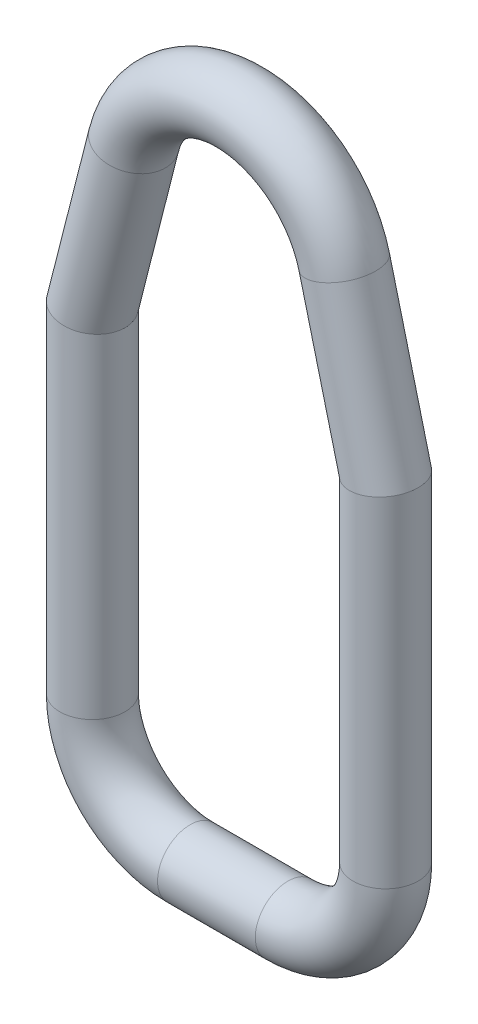
ISO-10303-21;
HEADER;
FILE_DESCRIPTION(('STEP AP214'),'2;1');
FILE_NAME('part.step','',(''),(''),'','','');
FILE_SCHEMA(('AUTOMOTIVE_DESIGN { 1 0 10303 214 1 1 1 1 }'));
ENDSEC;
DATA;
#1=APPLICATION_CONTEXT('core data for automotive mechanical design processes');
#2=APPLICATION_PROTOCOL_DEFINITION('international standard','automotive_design',2000,#1);
#3=PRODUCT_CONTEXT('',#1,'mechanical');
#4=PRODUCT('Part','Part','',(#3));
#5=PRODUCT_RELATED_PRODUCT_CATEGORY('part','',(#4));
#6=PRODUCT_DEFINITION_FORMATION('','',#4);
#7=PRODUCT_DEFINITION_CONTEXT('part definition',#1,'design');
#8=PRODUCT_DEFINITION('design','',#6,#7);
#9=PRODUCT_DEFINITION_SHAPE('','',#8);
#10=(LENGTH_UNIT() NAMED_UNIT(*) SI_UNIT(.MILLI.,.METRE.));
#11=(NAMED_UNIT(*) PLANE_ANGLE_UNIT() SI_UNIT($,.RADIAN.));
#12=(NAMED_UNIT(*) SI_UNIT($,.STERADIAN.) SOLID_ANGLE_UNIT());
#13=UNCERTAINTY_MEASURE_WITH_UNIT(LENGTH_MEASURE(1.E-05),#10,'distance_accuracy_value','');
#14=(GEOMETRIC_REPRESENTATION_CONTEXT(3) GLOBAL_UNCERTAINTY_ASSIGNED_CONTEXT((#13)) GLOBAL_UNIT_ASSIGNED_CONTEXT((#10,
#11,#12)) REPRESENTATION_CONTEXT('',''));
#15=CARTESIAN_POINT('',(0.,0.,0.));
#16=DIRECTION('',(0.,0.,1.));
#17=DIRECTION('',(1.,0.,0.));
#18=AXIS2_PLACEMENT_3D('',#15,#16,#17);
#19=CARTESIAN_POINT('',(-1.143,2.286,0.));
#20=DIRECTION('',(0.,0.,1.));
#21=DIRECTION('',(1.,0.,0.));
#22=AXIS2_PLACEMENT_3D('',#19,#20,#21);
#23=TOROIDAL_SURFACE('',#22,2.286,0.762);
#24=CARTESIAN_POINT('',(-3.429,2.286,0.));
#25=DIRECTION('',(0.,-1.,0.));
#26=DIRECTION('',(0.,0.,-1.));
#27=AXIS2_PLACEMENT_3D('',#24,#25,#26);
#28=CIRCLE('',#27,0.762);
#29=CARTESIAN_POINT('',(-4.191,2.286,0.));
#30=VERTEX_POINT('',#29);
#31=EDGE_CURVE('E51',#30,#30,#28,.T.);
#32=CARTESIAN_POINT('',(-1.143,0.,0.));
#33=DIRECTION('',(1.,0.,0.));
#34=DIRECTION('',(0.,0.,-1.));
#35=AXIS2_PLACEMENT_3D('',#32,#33,#34);
#36=CIRCLE('',#35,0.762);
#37=CARTESIAN_POINT('',(-1.143,-0.761999999999999,0.));
#38=VERTEX_POINT('',#37);
#39=EDGE_CURVE('E11',#38,#38,#36,.T.);
#40=CARTESIAN_POINT('',(-1.143,2.286,0.));
#41=DIRECTION('',(0.,0.,1.));
#42=DIRECTION('',(1.,0.,0.));
#43=AXIS2_PLACEMENT_3D('',#40,#41,#42);
#44=CIRCLE('',#43,3.048);
#45=EDGE_CURVE('',#30,#38,#44,.T.);
#46=ORIENTED_EDGE('',*,*,#31,.T.);
#47=ORIENTED_EDGE('',*,*,#39,.F.);
#48=ORIENTED_EDGE('',*,*,#45,.T.);
#49=ORIENTED_EDGE('',*,*,#45,.F.);
#50=EDGE_LOOP('',(#46,#48,#47,#49));
#51=FACE_BOUND('',#50,.T.);
#52=ADVANCED_FACE('F45',(#51),#23,.T.);
#53=CARTESIAN_POINT('',(-3.429,10.16,0.));
#54=DIRECTION('',(0.,-1.,0.));
#55=DIRECTION('',(1.,0.,0.));
#56=AXIS2_PLACEMENT_3D('',#53,#54,#55);
#57=CYLINDRICAL_SURFACE('',#56,0.762);
#58=CARTESIAN_POINT('',(-3.429,10.16,0.));
#59=DIRECTION('',(-0.124281895094547,-0.992246950386701,0.));
#60=DIRECTION('',(-0.992246950386701,0.124281895094547,0.));
#61=AXIS2_PLACEMENT_3D('',#58,#59,#60);
#62=ELLIPSE('',#61,0.767953985349143,0.762);
#63=CARTESIAN_POINT('',(-4.191,10.2554427766446,0.));
#64=VERTEX_POINT('',#63);
#65=EDGE_CURVE('E55',#64,#64,#62,.F.);
#66=ORIENTED_EDGE('',*,*,#65,.F.);
#67=EDGE_LOOP('',(#66));
#68=FACE_BOUND('',#67,.T.);
#69=ORIENTED_EDGE('',*,*,#31,.F.);
#70=EDGE_LOOP('',(#69));
#71=FACE_BOUND('',#70,.T.);
#72=ADVANCED_FACE('F89',(#68,#71),#57,.T.);
#73=CARTESIAN_POINT('',(-2.46153437360268,13.9614571234909,0.));
#74=DIRECTION('',(-0.246636662791689,-0.969108021103416,0.));
#75=DIRECTION('',(0.969108021103416,-0.246636662791689,0.));
#76=AXIS2_PLACEMENT_3D('',#73,#74,#75);
#77=CYLINDRICAL_SURFACE('',#76,0.762);
#78=CARTESIAN_POINT('',(-2.46153437360268,13.9614571234909,0.));
#79=DIRECTION('',(-0.246636662791689,-0.969108021103416,0.));
#80=DIRECTION('',(0.969108021103416,-0.246636662791689,0.));
#81=AXIS2_PLACEMENT_3D('',#78,#79,#80);
#82=CIRCLE('',#81,0.762);
#83=CARTESIAN_POINT('',(-3.19999468568348,14.1493942605382,0.));
#84=VERTEX_POINT('',#83);
#85=EDGE_CURVE('E59',#84,#84,#82,.T.);
#86=ORIENTED_EDGE('',*,*,#85,.T.);
#87=EDGE_LOOP('',(#86));
#88=FACE_BOUND('',#87,.T.);
#89=ORIENTED_EDGE('',*,*,#65,.T.);
#90=EDGE_LOOP('',(#89));
#91=FACE_BOUND('',#90,.T.);
#92=ADVANCED_FACE('F93',(#88,#91),#77,.T.);
#93=CARTESIAN_POINT('',(0.,13.335,0.));
#94=DIRECTION('',(0.,0.,1.));
#95=DIRECTION('',(1.,0.,0.));
#96=AXIS2_PLACEMENT_3D('',#93,#94,#95);
#97=TOROIDAL_SURFACE('',#96,2.54,0.762);
#98=CARTESIAN_POINT('',(2.46153437360268,13.9614571234909,0.));
#99=DIRECTION('',(-0.246636662791689,0.969108021103416,0.));
#100=DIRECTION('',(-0.969108021103416,-0.246636662791689,0.));
#101=AXIS2_PLACEMENT_3D('',#98,#99,#100);
#102=CIRCLE('',#101,0.762);
#103=CARTESIAN_POINT('',(3.19999468568348,14.1493942605382,0.));
#104=VERTEX_POINT('',#103);
#105=EDGE_CURVE('E64',#104,#104,#102,.T.);
#106=CARTESIAN_POINT('',(0.,13.335,0.));
#107=DIRECTION('',(0.,0.,1.));
#108=DIRECTION('',(1.,0.,0.));
#109=AXIS2_PLACEMENT_3D('',#106,#107,#108);
#110=CIRCLE('',#109,3.302);
#111=EDGE_CURVE('',#104,#84,#110,.T.);
#112=ORIENTED_EDGE('',*,*,#105,.T.);
#113=ORIENTED_EDGE('',*,*,#85,.F.);
#114=ORIENTED_EDGE('',*,*,#111,.T.);
#115=ORIENTED_EDGE('',*,*,#111,.F.);
#116=EDGE_LOOP('',(#112,#114,#113,#115));
#117=FACE_BOUND('',#116,.T.);
#118=ADVANCED_FACE('F99',(#117),#97,.T.);
#119=CARTESIAN_POINT('',(3.429,10.16,0.));
#120=DIRECTION('',(-0.246636662791689,0.969108021103416,0.));
#121=DIRECTION('',(-0.969108021103416,-0.246636662791689,0.));
#122=AXIS2_PLACEMENT_3D('',#119,#120,#121);
#123=CYLINDRICAL_SURFACE('',#122,0.762);
#124=CARTESIAN_POINT('',(3.429,10.16,0.));
#125=DIRECTION('',(-0.124281895094547,0.992246950386701,0.));
#126=DIRECTION('',(0.992246950386701,0.124281895094547,0.));
#127=AXIS2_PLACEMENT_3D('',#124,#125,#126);
#128=ELLIPSE('',#127,0.767953985349143,0.762);
#129=CARTESIAN_POINT('',(4.191,10.2554427766446,0.));
#130=VERTEX_POINT('',#129);
#131=EDGE_CURVE('E67',#130,#130,#128,.F.);
#132=ORIENTED_EDGE('',*,*,#131,.F.);
#133=EDGE_LOOP('',(#132));
#134=FACE_BOUND('',#133,.T.);
#135=ORIENTED_EDGE('',*,*,#105,.F.);
#136=EDGE_LOOP('',(#135));
#137=FACE_BOUND('',#136,.T.);
#138=ADVANCED_FACE('F107',(#134,#137),#123,.T.);
#139=CARTESIAN_POINT('',(3.429,2.286,0.));
#140=DIRECTION('',(0.,1.,0.));
#141=DIRECTION('',(0.,0.,1.));
#142=AXIS2_PLACEMENT_3D('',#139,#140,#141);
#143=CYLINDRICAL_SURFACE('',#142,0.762);
#144=CARTESIAN_POINT('',(3.429,2.286,0.));
#145=DIRECTION('',(0.,1.,0.));
#146=DIRECTION('',(0.,0.,-1.));
#147=AXIS2_PLACEMENT_3D('',#144,#145,#146);
#148=CIRCLE('',#147,0.762);
#149=CARTESIAN_POINT('',(4.191,2.286,0.));
#150=VERTEX_POINT('',#149);
#151=EDGE_CURVE('E70',#150,#150,#148,.T.);
#152=ORIENTED_EDGE('',*,*,#151,.T.);
#153=EDGE_LOOP('',(#152));
#154=FACE_BOUND('',#153,.T.);
#155=ORIENTED_EDGE('',*,*,#131,.T.);
#156=EDGE_LOOP('',(#155));
#157=FACE_BOUND('',#156,.T.);
#158=ADVANCED_FACE('F86',(#154,#157),#143,.T.);
#159=CARTESIAN_POINT('',(1.143,2.286,0.));
#160=DIRECTION('',(0.,0.,1.));
#161=DIRECTION('',(1.,0.,0.));
#162=AXIS2_PLACEMENT_3D('',#159,#160,#161);
#163=TOROIDAL_SURFACE('',#162,2.286,0.762);
#164=CARTESIAN_POINT('',(1.143,0.,0.));
#165=DIRECTION('',(1.,0.,0.));
#166=DIRECTION('',(0.,0.,-1.));
#167=AXIS2_PLACEMENT_3D('',#164,#165,#166);
#168=CIRCLE('',#167,0.762);
#169=CARTESIAN_POINT('',(1.143,-0.762000000000001,0.));
#170=VERTEX_POINT('',#169);
#171=EDGE_CURVE('E73',#170,#170,#168,.T.);
#172=CARTESIAN_POINT('',(1.143,2.286,0.));
#173=DIRECTION('',(0.,0.,1.));
#174=DIRECTION('',(1.,0.,0.));
#175=AXIS2_PLACEMENT_3D('',#172,#173,#174);
#176=CIRCLE('',#175,3.048);
#177=EDGE_CURVE('',#170,#150,#176,.T.);
#178=ORIENTED_EDGE('',*,*,#171,.T.);
#179=ORIENTED_EDGE('',*,*,#151,.F.);
#180=ORIENTED_EDGE('',*,*,#177,.T.);
#181=ORIENTED_EDGE('',*,*,#177,.F.);
#182=EDGE_LOOP('',(#178,#180,#179,#181));
#183=FACE_BOUND('',#182,.T.);
#184=ADVANCED_FACE('F77',(#183),#163,.T.);
#185=CARTESIAN_POINT('',(1.143,0.,0.));
#186=DIRECTION('',(-1.,0.,0.));
#187=DIRECTION('',(0.,-1.,0.));
#188=AXIS2_PLACEMENT_3D('',#185,#186,#187);
#189=CYLINDRICAL_SURFACE('',#188,0.762);
#190=ORIENTED_EDGE('',*,*,#171,.F.);
#191=EDGE_LOOP('',(#190));
#192=FACE_BOUND('',#191,.T.);
#193=ORIENTED_EDGE('',*,*,#39,.T.);
#194=EDGE_LOOP('',(#193));
#195=FACE_BOUND('',#194,.T.);
#196=ADVANCED_FACE('F80',(#192,#195),#189,.T.);
#197=CLOSED_SHELL('',(#52,#72,#92,#118,#138,#158,#184,#196));
#198=MANIFOLD_SOLID_BREP('B2',#197);
#199=ADVANCED_BREP_SHAPE_REPRESENTATION('',(#18,#198),#14);
#200=SHAPE_DEFINITION_REPRESENTATION(#9,#199);
ENDSEC;
END-ISO-10303-21;
